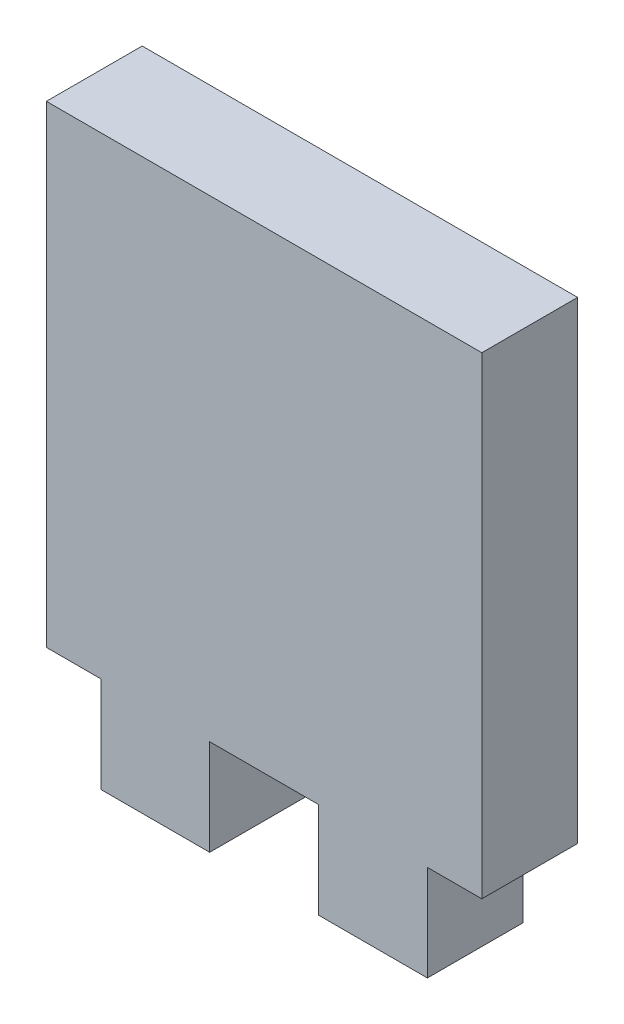
ISO-10303-21;
HEADER;
FILE_DESCRIPTION(('STEP AP214'),'2;1');
FILE_NAME('part.step','',(''),(''),'','','');
FILE_SCHEMA(('AUTOMOTIVE_DESIGN { 1 0 10303 214 1 1 1 1 }'));
ENDSEC;
DATA;
#1=APPLICATION_CONTEXT('core data for automotive mechanical design processes');
#2=APPLICATION_PROTOCOL_DEFINITION('international standard','automotive_design',2000,#1);
#3=PRODUCT_CONTEXT('',#1,'mechanical');
#4=PRODUCT('Part','Part','',(#3));
#5=PRODUCT_RELATED_PRODUCT_CATEGORY('part','',(#4));
#6=PRODUCT_DEFINITION_FORMATION('','',#4);
#7=PRODUCT_DEFINITION_CONTEXT('part definition',#1,'design');
#8=PRODUCT_DEFINITION('design','',#6,#7);
#9=PRODUCT_DEFINITION_SHAPE('','',#8);
#10=(LENGTH_UNIT() NAMED_UNIT(*) SI_UNIT(.MILLI.,.METRE.));
#11=(NAMED_UNIT(*) PLANE_ANGLE_UNIT() SI_UNIT($,.RADIAN.));
#12=(NAMED_UNIT(*) SI_UNIT($,.STERADIAN.) SOLID_ANGLE_UNIT());
#13=UNCERTAINTY_MEASURE_WITH_UNIT(LENGTH_MEASURE(1.E-05),#10,'distance_accuracy_value','');
#14=(GEOMETRIC_REPRESENTATION_CONTEXT(3) GLOBAL_UNCERTAINTY_ASSIGNED_CONTEXT((#13)) GLOBAL_UNIT_ASSIGNED_CONTEXT((#10,
#11,#12)) REPRESENTATION_CONTEXT('',''));
#15=CARTESIAN_POINT('',(0.,0.,0.));
#16=DIRECTION('',(0.,0.,1.));
#17=DIRECTION('',(1.,0.,0.));
#18=AXIS2_PLACEMENT_3D('',#15,#16,#17);
#19=CARTESIAN_POINT('',(0.,0.,5.588));
#20=DIRECTION('',(1.,0.,0.));
#21=DIRECTION('',(0.,1.,0.));
#22=AXIS2_PLACEMENT_3D('',#19,#20,#21);
#23=PLANE('',#22);
#24=DIRECTION('',(0.,-1.,0.));
#25=VECTOR('',#24,1.);
#26=CARTESIAN_POINT('',(0.,0.,0.));
#27=LINE('',#26,#25);
#28=CARTESIAN_POINT('',(0.,27.588,0.));
#29=VERTEX_POINT('',#28);
#30=CARTESIAN_POINT('',(0.,0.,0.));
#31=VERTEX_POINT('',#30);
#32=EDGE_CURVE('E153',#29,#31,#27,.T.);
#33=ORIENTED_EDGE('',*,*,#32,.T.);
#34=DIRECTION('',(0.,0.,-1.));
#35=VECTOR('',#34,1.);
#36=CARTESIAN_POINT('',(0.,0.,5.588));
#37=LINE('',#36,#35);
#38=CARTESIAN_POINT('',(0.,0.,5.588));
#39=VERTEX_POINT('',#38);
#40=EDGE_CURVE('E11',#39,#31,#37,.T.);
#41=ORIENTED_EDGE('',*,*,#40,.F.);
#42=DIRECTION('',(0.,-1.,0.));
#43=VECTOR('',#42,1.);
#44=CARTESIAN_POINT('',(0.,0.,5.588));
#45=LINE('',#44,#43);
#46=CARTESIAN_POINT('',(0.,27.588,5.588));
#47=VERTEX_POINT('',#46);
#48=EDGE_CURVE('E175',#47,#39,#45,.T.);
#49=ORIENTED_EDGE('',*,*,#48,.F.);
#50=DIRECTION('',(0.,0.,-1.));
#51=VECTOR('',#50,1.);
#52=CARTESIAN_POINT('',(0.,27.588,5.588));
#53=LINE('',#52,#51);
#54=EDGE_CURVE('E149',#47,#29,#53,.T.);
#55=ORIENTED_EDGE('',*,*,#54,.T.);
#56=EDGE_LOOP('',(#33,#41,#49,#55));
#57=FACE_BOUND('',#56,.T.);
#58=ADVANCED_FACE('F33',(#57),#23,.F.);
#59=CARTESIAN_POINT('',(0.,0.,5.588));
#60=DIRECTION('',(0.,1.,0.));
#61=DIRECTION('',(-1.,0.,0.));
#62=AXIS2_PLACEMENT_3D('',#59,#60,#61);
#63=PLANE('',#62);
#64=DIRECTION('',(1.,0.,0.));
#65=VECTOR('',#64,1.);
#66=CARTESIAN_POINT('',(0.,0.,0.));
#67=LINE('',#66,#65);
#68=CARTESIAN_POINT('',(3.175,0.,0.));
#69=VERTEX_POINT('',#68);
#70=EDGE_CURVE('E156',#31,#69,#67,.T.);
#71=ORIENTED_EDGE('',*,*,#70,.T.);
#72=DIRECTION('',(0.,0.,-1.));
#73=VECTOR('',#72,1.);
#74=CARTESIAN_POINT('',(3.175,0.,5.588));
#75=LINE('',#74,#73);
#76=CARTESIAN_POINT('',(3.175,0.,5.588));
#77=VERTEX_POINT('',#76);
#78=EDGE_CURVE('E41',#77,#69,#75,.T.);
#79=ORIENTED_EDGE('',*,*,#78,.F.);
#80=DIRECTION('',(1.,0.,0.));
#81=VECTOR('',#80,1.);
#82=CARTESIAN_POINT('',(0.,0.,5.588));
#83=LINE('',#82,#81);
#84=EDGE_CURVE('E104',#39,#77,#83,.T.);
#85=ORIENTED_EDGE('',*,*,#84,.F.);
#86=ORIENTED_EDGE('',*,*,#40,.T.);
#87=EDGE_LOOP('',(#71,#79,#85,#86));
#88=FACE_BOUND('',#87,.T.);
#89=ADVANCED_FACE('F253',(#88),#63,.F.);
#90=CARTESIAN_POINT('',(3.175,0.,5.588));
#91=DIRECTION('',(1.,0.,0.));
#92=DIRECTION('',(0.,0.,-1.));
#93=AXIS2_PLACEMENT_3D('',#90,#91,#92);
#94=PLANE('',#93);
#95=DIRECTION('',(0.,-1.,0.));
#96=VECTOR('',#95,1.);
#97=CARTESIAN_POINT('',(3.175,0.,0.));
#98=LINE('',#97,#96);
#99=CARTESIAN_POINT('',(3.175,-5.588,0.));
#100=VERTEX_POINT('',#99);
#101=EDGE_CURVE('E158',#69,#100,#98,.T.);
#102=ORIENTED_EDGE('',*,*,#101,.T.);
#103=DIRECTION('',(0.,0.,-1.));
#104=VECTOR('',#103,1.);
#105=CARTESIAN_POINT('',(3.175,-5.588,5.588));
#106=LINE('',#105,#104);
#107=CARTESIAN_POINT('',(3.175,-5.588,5.588));
#108=VERTEX_POINT('',#107);
#109=EDGE_CURVE('E194',#108,#100,#106,.T.);
#110=ORIENTED_EDGE('',*,*,#109,.F.);
#111=DIRECTION('',(0.,-1.,0.));
#112=VECTOR('',#111,1.);
#113=CARTESIAN_POINT('',(3.175,0.,5.588));
#114=LINE('',#113,#112);
#115=EDGE_CURVE('E202',#77,#108,#114,.T.);
#116=ORIENTED_EDGE('',*,*,#115,.F.);
#117=ORIENTED_EDGE('',*,*,#78,.T.);
#118=EDGE_LOOP('',(#102,#110,#116,#117));
#119=FACE_BOUND('',#118,.T.);
#120=ADVANCED_FACE('F200',(#119),#94,.F.);
#121=CARTESIAN_POINT('',(3.175,-5.588,5.588));
#122=DIRECTION('',(0.,1.,0.));
#123=DIRECTION('',(0.,0.,1.));
#124=AXIS2_PLACEMENT_3D('',#121,#122,#123);
#125=PLANE('',#124);
#126=DIRECTION('',(1.,0.,0.));
#127=VECTOR('',#126,1.);
#128=CARTESIAN_POINT('',(3.175,-5.588,0.));
#129=LINE('',#128,#127);
#130=CARTESIAN_POINT('',(9.525,-5.588,0.));
#131=VERTEX_POINT('',#130);
#132=EDGE_CURVE('E160',#100,#131,#129,.T.);
#133=ORIENTED_EDGE('',*,*,#132,.T.);
#134=DIRECTION('',(0.,0.,-1.));
#135=VECTOR('',#134,1.);
#136=CARTESIAN_POINT('',(9.525,-5.588,5.588));
#137=LINE('',#136,#135);
#138=CARTESIAN_POINT('',(9.525,-5.588,5.588));
#139=VERTEX_POINT('',#138);
#140=EDGE_CURVE('E191',#139,#131,#137,.T.);
#141=ORIENTED_EDGE('',*,*,#140,.F.);
#142=DIRECTION('',(1.,0.,0.));
#143=VECTOR('',#142,1.);
#144=CARTESIAN_POINT('',(3.175,-5.588,5.588));
#145=LINE('',#144,#143);
#146=EDGE_CURVE('E220',#108,#139,#145,.T.);
#147=ORIENTED_EDGE('',*,*,#146,.F.);
#148=ORIENTED_EDGE('',*,*,#109,.T.);
#149=EDGE_LOOP('',(#133,#141,#147,#148));
#150=FACE_BOUND('',#149,.T.);
#151=ADVANCED_FACE('F211',(#150),#125,.F.);
#152=CARTESIAN_POINT('',(9.525,0.,5.588));
#153=DIRECTION('',(-1.,0.,0.));
#154=DIRECTION('',(0.,0.,1.));
#155=AXIS2_PLACEMENT_3D('',#152,#153,#154);
#156=PLANE('',#155);
#157=DIRECTION('',(0.,1.,0.));
#158=VECTOR('',#157,1.);
#159=CARTESIAN_POINT('',(9.525,0.,0.));
#160=LINE('',#159,#158);
#161=CARTESIAN_POINT('',(9.525,0.,0.));
#162=VERTEX_POINT('',#161);
#163=EDGE_CURVE('E162',#131,#162,#160,.T.);
#164=ORIENTED_EDGE('',*,*,#163,.T.);
#165=DIRECTION('',(0.,0.,-1.));
#166=VECTOR('',#165,1.);
#167=CARTESIAN_POINT('',(9.525,0.,5.588));
#168=LINE('',#167,#166);
#169=CARTESIAN_POINT('',(9.525,0.,5.588));
#170=VERTEX_POINT('',#169);
#171=EDGE_CURVE('E188',#170,#162,#168,.T.);
#172=ORIENTED_EDGE('',*,*,#171,.F.);
#173=DIRECTION('',(0.,1.,0.));
#174=VECTOR('',#173,1.);
#175=CARTESIAN_POINT('',(9.525,0.,5.588));
#176=LINE('',#175,#174);
#177=EDGE_CURVE('E217',#139,#170,#176,.T.);
#178=ORIENTED_EDGE('',*,*,#177,.F.);
#179=ORIENTED_EDGE('',*,*,#140,.T.);
#180=EDGE_LOOP('',(#164,#172,#178,#179));
#181=FACE_BOUND('',#180,.T.);
#182=ADVANCED_FACE('F215',(#181),#156,.F.);
#183=CARTESIAN_POINT('',(9.525,0.,5.588));
#184=DIRECTION('',(0.,1.,0.));
#185=DIRECTION('',(-1.,0.,0.));
#186=AXIS2_PLACEMENT_3D('',#183,#184,#185);
#187=PLANE('',#186);
#188=DIRECTION('',(1.,0.,0.));
#189=VECTOR('',#188,1.);
#190=CARTESIAN_POINT('',(9.525,0.,0.));
#191=LINE('',#190,#189);
#192=CARTESIAN_POINT('',(15.875,0.,0.));
#193=VERTEX_POINT('',#192);
#194=EDGE_CURVE('E164',#162,#193,#191,.T.);
#195=ORIENTED_EDGE('',*,*,#194,.T.);
#196=DIRECTION('',(0.,0.,-1.));
#197=VECTOR('',#196,1.);
#198=CARTESIAN_POINT('',(15.875,0.,5.588));
#199=LINE('',#198,#197);
#200=CARTESIAN_POINT('',(15.875,0.,5.588));
#201=VERTEX_POINT('',#200);
#202=EDGE_CURVE('E185',#201,#193,#199,.T.);
#203=ORIENTED_EDGE('',*,*,#202,.F.);
#204=DIRECTION('',(1.,0.,0.));
#205=VECTOR('',#204,1.);
#206=CARTESIAN_POINT('',(9.525,0.,5.588));
#207=LINE('',#206,#205);
#208=EDGE_CURVE('E219',#170,#201,#207,.T.);
#209=ORIENTED_EDGE('',*,*,#208,.F.);
#210=ORIENTED_EDGE('',*,*,#171,.T.);
#211=EDGE_LOOP('',(#195,#203,#209,#210));
#212=FACE_BOUND('',#211,.T.);
#213=ADVANCED_FACE('F266',(#212),#187,.F.);
#214=CARTESIAN_POINT('',(15.875,0.,5.588));
#215=DIRECTION('',(1.,0.,0.));
#216=DIRECTION('',(0.,0.,-1.));
#217=AXIS2_PLACEMENT_3D('',#214,#215,#216);
#218=PLANE('',#217);
#219=DIRECTION('',(0.,-1.,0.));
#220=VECTOR('',#219,1.);
#221=CARTESIAN_POINT('',(15.875,0.,0.));
#222=LINE('',#221,#220);
#223=CARTESIAN_POINT('',(15.875,-5.588,0.));
#224=VERTEX_POINT('',#223);
#225=EDGE_CURVE('E166',#193,#224,#222,.T.);
#226=ORIENTED_EDGE('',*,*,#225,.T.);
#227=DIRECTION('',(0.,0.,-1.));
#228=VECTOR('',#227,1.);
#229=CARTESIAN_POINT('',(15.875,-5.588,5.588));
#230=LINE('',#229,#228);
#231=CARTESIAN_POINT('',(15.875,-5.588,5.588));
#232=VERTEX_POINT('',#231);
#233=EDGE_CURVE('E182',#232,#224,#230,.T.);
#234=ORIENTED_EDGE('',*,*,#233,.F.);
#235=DIRECTION('',(0.,-1.,0.));
#236=VECTOR('',#235,1.);
#237=CARTESIAN_POINT('',(15.875,0.,5.588));
#238=LINE('',#237,#236);
#239=EDGE_CURVE('E222',#201,#232,#238,.T.);
#240=ORIENTED_EDGE('',*,*,#239,.F.);
#241=ORIENTED_EDGE('',*,*,#202,.T.);
#242=EDGE_LOOP('',(#226,#234,#240,#241));
#243=FACE_BOUND('',#242,.T.);
#244=ADVANCED_FACE('F269',(#243),#218,.F.);
#245=CARTESIAN_POINT('',(15.875,-5.588,5.588));
#246=DIRECTION('',(0.,1.,0.));
#247=DIRECTION('',(-1.,0.,0.));
#248=AXIS2_PLACEMENT_3D('',#245,#246,#247);
#249=PLANE('',#248);
#250=DIRECTION('',(1.,0.,0.));
#251=VECTOR('',#250,1.);
#252=CARTESIAN_POINT('',(15.875,-5.588,0.));
#253=LINE('',#252,#251);
#254=CARTESIAN_POINT('',(22.225,-5.588,0.));
#255=VERTEX_POINT('',#254);
#256=EDGE_CURVE('E168',#224,#255,#253,.T.);
#257=ORIENTED_EDGE('',*,*,#256,.T.);
#258=DIRECTION('',(0.,0.,-1.));
#259=VECTOR('',#258,1.);
#260=CARTESIAN_POINT('',(22.225,-5.588,5.588));
#261=LINE('',#260,#259);
#262=CARTESIAN_POINT('',(22.225,-5.588,5.588));
#263=VERTEX_POINT('',#262);
#264=EDGE_CURVE('E179',#263,#255,#261,.T.);
#265=ORIENTED_EDGE('',*,*,#264,.F.);
#266=DIRECTION('',(1.,0.,0.));
#267=VECTOR('',#266,1.);
#268=CARTESIAN_POINT('',(15.875,-5.588,5.588));
#269=LINE('',#268,#267);
#270=EDGE_CURVE('E228',#232,#263,#269,.T.);
#271=ORIENTED_EDGE('',*,*,#270,.F.);
#272=ORIENTED_EDGE('',*,*,#233,.T.);
#273=EDGE_LOOP('',(#257,#265,#271,#272));
#274=FACE_BOUND('',#273,.T.);
#275=ADVANCED_FACE('F234',(#274),#249,.F.);
#276=CARTESIAN_POINT('',(22.225,0.,5.588));
#277=DIRECTION('',(-1.,0.,0.));
#278=DIRECTION('',(0.,0.,1.));
#279=AXIS2_PLACEMENT_3D('',#276,#277,#278);
#280=PLANE('',#279);
#281=DIRECTION('',(0.,1.,0.));
#282=VECTOR('',#281,1.);
#283=CARTESIAN_POINT('',(22.225,0.,0.));
#284=LINE('',#283,#282);
#285=CARTESIAN_POINT('',(22.225,0.,0.));
#286=VERTEX_POINT('',#285);
#287=EDGE_CURVE('E170',#255,#286,#284,.T.);
#288=ORIENTED_EDGE('',*,*,#287,.T.);
#289=DIRECTION('',(0.,0.,-1.));
#290=VECTOR('',#289,1.);
#291=CARTESIAN_POINT('',(22.225,0.,5.588));
#292=LINE('',#291,#290);
#293=CARTESIAN_POINT('',(22.225,0.,5.588));
#294=VERTEX_POINT('',#293);
#295=EDGE_CURVE('E144',#294,#286,#292,.T.);
#296=ORIENTED_EDGE('',*,*,#295,.F.);
#297=DIRECTION('',(0.,1.,0.));
#298=VECTOR('',#297,1.);
#299=CARTESIAN_POINT('',(22.225,0.,5.588));
#300=LINE('',#299,#298);
#301=EDGE_CURVE('E135',#263,#294,#300,.T.);
#302=ORIENTED_EDGE('',*,*,#301,.F.);
#303=ORIENTED_EDGE('',*,*,#264,.T.);
#304=EDGE_LOOP('',(#288,#296,#302,#303));
#305=FACE_BOUND('',#304,.T.);
#306=ADVANCED_FACE('F238',(#305),#280,.F.);
#307=CARTESIAN_POINT('',(22.225,0.,5.588));
#308=DIRECTION('',(0.,1.,0.));
#309=DIRECTION('',(-1.,0.,0.));
#310=AXIS2_PLACEMENT_3D('',#307,#308,#309);
#311=PLANE('',#310);
#312=DIRECTION('',(1.,0.,0.));
#313=VECTOR('',#312,1.);
#314=CARTESIAN_POINT('',(22.225,0.,0.));
#315=LINE('',#314,#313);
#316=CARTESIAN_POINT('',(25.4,0.,0.));
#317=VERTEX_POINT('',#316);
#318=EDGE_CURVE('E143',#286,#317,#315,.T.);
#319=ORIENTED_EDGE('',*,*,#318,.T.);
#320=DIRECTION('',(0.,0.,-1.));
#321=VECTOR('',#320,1.);
#322=CARTESIAN_POINT('',(25.4,0.,5.588));
#323=LINE('',#322,#321);
#324=CARTESIAN_POINT('',(25.4,0.,5.588));
#325=VERTEX_POINT('',#324);
#326=EDGE_CURVE('E140',#325,#317,#323,.T.);
#327=ORIENTED_EDGE('',*,*,#326,.F.);
#328=DIRECTION('',(1.,0.,0.));
#329=VECTOR('',#328,1.);
#330=CARTESIAN_POINT('',(22.225,0.,5.588));
#331=LINE('',#330,#329);
#332=EDGE_CURVE('E129',#294,#325,#331,.T.);
#333=ORIENTED_EDGE('',*,*,#332,.F.);
#334=ORIENTED_EDGE('',*,*,#295,.T.);
#335=EDGE_LOOP('',(#319,#327,#333,#334));
#336=FACE_BOUND('',#335,.T.);
#337=ADVANCED_FACE('F141',(#336),#311,.F.);
#338=CARTESIAN_POINT('',(25.4,0.,5.588));
#339=DIRECTION('',(-1.,0.,0.));
#340=DIRECTION('',(0.,-1.,0.));
#341=AXIS2_PLACEMENT_3D('',#338,#339,#340);
#342=PLANE('',#341);
#343=DIRECTION('',(0.,1.,0.));
#344=VECTOR('',#343,1.);
#345=CARTESIAN_POINT('',(25.4,0.,0.));
#346=LINE('',#345,#344);
#347=CARTESIAN_POINT('',(25.4,27.588,0.));
#348=VERTEX_POINT('',#347);
#349=EDGE_CURVE('E90',#317,#348,#346,.T.);
#350=ORIENTED_EDGE('',*,*,#349,.T.);
#351=DIRECTION('',(0.,0.,-1.));
#352=VECTOR('',#351,1.);
#353=CARTESIAN_POINT('',(25.4,27.588,5.588));
#354=LINE('',#353,#352);
#355=CARTESIAN_POINT('',(25.4,27.588,5.588));
#356=VERTEX_POINT('',#355);
#357=EDGE_CURVE('E145',#356,#348,#354,.T.);
#358=ORIENTED_EDGE('',*,*,#357,.F.);
#359=DIRECTION('',(0.,1.,0.));
#360=VECTOR('',#359,1.);
#361=CARTESIAN_POINT('',(25.4,0.,5.588));
#362=LINE('',#361,#360);
#363=EDGE_CURVE('E133',#325,#356,#362,.T.);
#364=ORIENTED_EDGE('',*,*,#363,.F.);
#365=ORIENTED_EDGE('',*,*,#326,.T.);
#366=EDGE_LOOP('',(#350,#358,#364,#365));
#367=FACE_BOUND('',#366,.T.);
#368=ADVANCED_FACE('F147',(#367),#342,.F.);
#369=CARTESIAN_POINT('',(0.,27.588,5.588));
#370=DIRECTION('',(0.,-1.,0.));
#371=DIRECTION('',(1.,0.,0.));
#372=AXIS2_PLACEMENT_3D('',#369,#370,#371);
#373=PLANE('',#372);
#374=DIRECTION('',(-1.,0.,0.));
#375=VECTOR('',#374,1.);
#376=CARTESIAN_POINT('',(0.,27.588,0.));
#377=LINE('',#376,#375);
#378=EDGE_CURVE('E96',#348,#29,#377,.T.);
#379=ORIENTED_EDGE('',*,*,#378,.T.);
#380=ORIENTED_EDGE('',*,*,#54,.F.);
#381=DIRECTION('',(-1.,0.,0.));
#382=VECTOR('',#381,1.);
#383=CARTESIAN_POINT('',(0.,27.588,5.588));
#384=LINE('',#383,#382);
#385=EDGE_CURVE('E49',#356,#47,#384,.T.);
#386=ORIENTED_EDGE('',*,*,#385,.F.);
#387=ORIENTED_EDGE('',*,*,#357,.T.);
#388=EDGE_LOOP('',(#379,#380,#386,#387));
#389=FACE_BOUND('',#388,.T.);
#390=ADVANCED_FACE('F242',(#389),#373,.F.);
#391=CARTESIAN_POINT('',(0.,0.,5.588));
#392=DIRECTION('',(0.,0.,-1.));
#393=DIRECTION('',(-1.,0.,0.));
#394=AXIS2_PLACEMENT_3D('',#391,#392,#393);
#395=PLANE('',#394);
#396=ORIENTED_EDGE('',*,*,#48,.T.);
#397=ORIENTED_EDGE('',*,*,#84,.T.);
#398=ORIENTED_EDGE('',*,*,#115,.T.);
#399=ORIENTED_EDGE('',*,*,#146,.T.);
#400=ORIENTED_EDGE('',*,*,#177,.T.);
#401=ORIENTED_EDGE('',*,*,#208,.T.);
#402=ORIENTED_EDGE('',*,*,#239,.T.);
#403=ORIENTED_EDGE('',*,*,#270,.T.);
#404=ORIENTED_EDGE('',*,*,#301,.T.);
#405=ORIENTED_EDGE('',*,*,#332,.T.);
#406=ORIENTED_EDGE('',*,*,#363,.T.);
#407=ORIENTED_EDGE('',*,*,#385,.T.);
#408=EDGE_LOOP('',(#396,#397,#398,#399,#400,#401,#402,#403,#404,#405,#406,#407));
#409=FACE_BOUND('',#408,.T.);
#410=ADVANCED_FACE('F131',(#409),#395,.F.);
#411=CARTESIAN_POINT('',(0.,0.,0.));
#412=DIRECTION('',(0.,0.,-1.));
#413=DIRECTION('',(-1.,0.,0.));
#414=AXIS2_PLACEMENT_3D('',#411,#412,#413);
#415=PLANE('',#414);
#416=ORIENTED_EDGE('',*,*,#32,.F.);
#417=ORIENTED_EDGE('',*,*,#378,.F.);
#418=ORIENTED_EDGE('',*,*,#349,.F.);
#419=ORIENTED_EDGE('',*,*,#318,.F.);
#420=ORIENTED_EDGE('',*,*,#287,.F.);
#421=ORIENTED_EDGE('',*,*,#256,.F.);
#422=ORIENTED_EDGE('',*,*,#225,.F.);
#423=ORIENTED_EDGE('',*,*,#194,.F.);
#424=ORIENTED_EDGE('',*,*,#163,.F.);
#425=ORIENTED_EDGE('',*,*,#132,.F.);
#426=ORIENTED_EDGE('',*,*,#101,.F.);
#427=ORIENTED_EDGE('',*,*,#70,.F.);
#428=EDGE_LOOP('',(#416,#417,#418,#419,#420,#421,#422,#423,#424,#425,#426,#427));
#429=FACE_BOUND('',#428,.T.);
#430=ADVANCED_FACE('F206',(#429),#415,.T.);
#431=CLOSED_SHELL('',(#58,#89,#120,#151,#182,#213,#244,#275,#306,#337,#368,#390,#410,#430));
#432=MANIFOLD_SOLID_BREP('B2',#431);
#433=ADVANCED_BREP_SHAPE_REPRESENTATION('',(#18,#432),#14);
#434=SHAPE_DEFINITION_REPRESENTATION(#9,#433);
ENDSEC;
END-ISO-10303-21;
